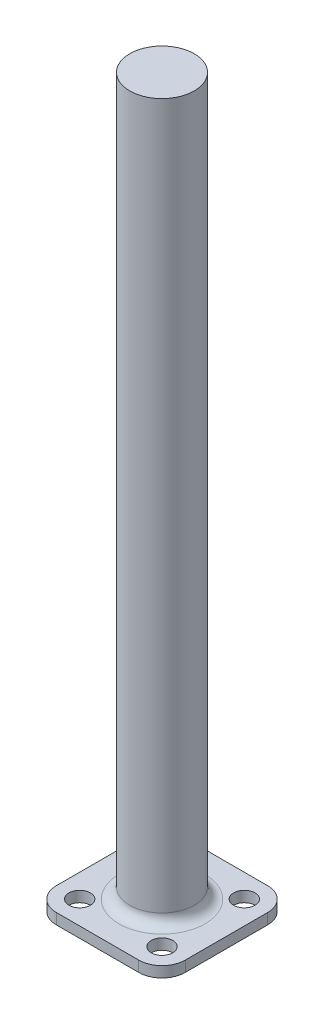
ISO-10303-21;
HEADER;
FILE_DESCRIPTION(('STEP AP214'),'2;1');
FILE_NAME('part.step','',(''),(''),'','','');
FILE_SCHEMA(('AUTOMOTIVE_DESIGN { 1 0 10303 214 1 1 1 1 }'));
ENDSEC;
DATA;
#1=APPLICATION_CONTEXT('core data for automotive mechanical design processes');
#2=APPLICATION_PROTOCOL_DEFINITION('international standard','automotive_design',2000,#1);
#3=PRODUCT_CONTEXT('',#1,'mechanical');
#4=PRODUCT('Part','Part','',(#3));
#5=PRODUCT_RELATED_PRODUCT_CATEGORY('part','',(#4));
#6=PRODUCT_DEFINITION_FORMATION('','',#4);
#7=PRODUCT_DEFINITION_CONTEXT('part definition',#1,'design');
#8=PRODUCT_DEFINITION('design','',#6,#7);
#9=PRODUCT_DEFINITION_SHAPE('','',#8);
#10=(LENGTH_UNIT() NAMED_UNIT(*) SI_UNIT(.MILLI.,.METRE.));
#11=(NAMED_UNIT(*) PLANE_ANGLE_UNIT() SI_UNIT($,.RADIAN.));
#12=(NAMED_UNIT(*) SI_UNIT($,.STERADIAN.) SOLID_ANGLE_UNIT());
#13=UNCERTAINTY_MEASURE_WITH_UNIT(LENGTH_MEASURE(1.E-05),#10,'distance_accuracy_value','');
#14=(GEOMETRIC_REPRESENTATION_CONTEXT(3) GLOBAL_UNCERTAINTY_ASSIGNED_CONTEXT((#13)) GLOBAL_UNIT_ASSIGNED_CONTEXT((#10,
#11,#12)) REPRESENTATION_CONTEXT('',''));
#15=CARTESIAN_POINT('',(0.,0.,0.));
#16=DIRECTION('',(0.,0.,1.));
#17=DIRECTION('',(1.,0.,0.));
#18=AXIS2_PLACEMENT_3D('',#15,#16,#17);
#19=CARTESIAN_POINT('',(-9.,1.5,0.));
#20=DIRECTION('',(1.,0.,0.));
#21=DIRECTION('',(0.,0.,-1.));
#22=AXIS2_PLACEMENT_3D('',#19,#20,#21);
#23=PLANE('',#22);
#24=DIRECTION('',(0.,0.,1.));
#25=VECTOR('',#24,1.);
#26=CARTESIAN_POINT('',(-9.,0.,0.));
#27=LINE('',#26,#25);
#28=CARTESIAN_POINT('',(-9.,0.,-5.75));
#29=VERTEX_POINT('',#28);
#30=CARTESIAN_POINT('',(-9.,0.,5.75));
#31=VERTEX_POINT('',#30);
#32=EDGE_CURVE('E148',#29,#31,#27,.T.);
#33=ORIENTED_EDGE('',*,*,#32,.T.);
#34=DIRECTION('',(0.,-1.,0.));
#35=VECTOR('',#34,1.);
#36=CARTESIAN_POINT('',(-9.,1.5,5.75));
#37=LINE('',#36,#35);
#38=CARTESIAN_POINT('',(-9.,1.5,5.75));
#39=VERTEX_POINT('',#38);
#40=EDGE_CURVE('E177',#39,#31,#37,.T.);
#41=ORIENTED_EDGE('',*,*,#40,.F.);
#42=DIRECTION('',(0.,0.,1.));
#43=VECTOR('',#42,1.);
#44=CARTESIAN_POINT('',(-9.,1.5,0.));
#45=LINE('',#44,#43);
#46=CARTESIAN_POINT('',(-9.,1.5,-5.75));
#47=VERTEX_POINT('',#46);
#48=EDGE_CURVE('E242',#47,#39,#45,.T.);
#49=ORIENTED_EDGE('',*,*,#48,.F.);
#50=DIRECTION('',(0.,-1.,0.));
#51=VECTOR('',#50,1.);
#52=CARTESIAN_POINT('',(-9.,1.5,-5.75));
#53=LINE('',#52,#51);
#54=EDGE_CURVE('E131',#47,#29,#53,.T.);
#55=ORIENTED_EDGE('',*,*,#54,.T.);
#56=EDGE_LOOP('',(#33,#41,#49,#55));
#57=FACE_BOUND('',#56,.T.);
#58=ADVANCED_FACE('F39',(#57),#23,.F.);
#59=CARTESIAN_POINT('',(-5.75,1.5,5.75));
#60=DIRECTION('',(0.,-1.,0.));
#61=DIRECTION('',(0.,0.,-1.));
#62=AXIS2_PLACEMENT_3D('',#59,#60,#61);
#63=CYLINDRICAL_SURFACE('',#62,3.25);
#64=CARTESIAN_POINT('',(-5.75,0.,5.75));
#65=DIRECTION('',(0.,1.,0.));
#66=DIRECTION('',(0.,0.,1.));
#67=AXIS2_PLACEMENT_3D('',#64,#65,#66);
#68=CIRCLE('',#67,3.25);
#69=CARTESIAN_POINT('',(-5.75,0.,9.));
#70=VERTEX_POINT('',#69);
#71=EDGE_CURVE('E151',#31,#70,#68,.T.);
#72=ORIENTED_EDGE('',*,*,#71,.T.);
#73=DIRECTION('',(0.,-1.,0.));
#74=VECTOR('',#73,1.);
#75=CARTESIAN_POINT('',(-5.75,1.5,9.));
#76=LINE('',#75,#74);
#77=CARTESIAN_POINT('',(-5.75,1.5,9.));
#78=VERTEX_POINT('',#77);
#79=EDGE_CURVE('E174',#78,#70,#76,.T.);
#80=ORIENTED_EDGE('',*,*,#79,.F.);
#81=CARTESIAN_POINT('',(-5.75,1.5,5.75));
#82=DIRECTION('',(0.,1.,0.));
#83=DIRECTION('',(0.,0.,1.));
#84=AXIS2_PLACEMENT_3D('',#81,#82,#83);
#85=CIRCLE('',#84,3.25);
#86=EDGE_CURVE('E96',#39,#78,#85,.T.);
#87=ORIENTED_EDGE('',*,*,#86,.F.);
#88=ORIENTED_EDGE('',*,*,#40,.T.);
#89=EDGE_LOOP('',(#72,#80,#87,#88));
#90=FACE_BOUND('',#89,.T.);
#91=ADVANCED_FACE('F194',(#90),#63,.T.);
#92=CARTESIAN_POINT('',(0.,1.5,9.));
#93=DIRECTION('',(0.,0.,-1.));
#94=DIRECTION('',(-1.,0.,0.));
#95=AXIS2_PLACEMENT_3D('',#92,#93,#94);
#96=PLANE('',#95);
#97=DIRECTION('',(1.,0.,0.));
#98=VECTOR('',#97,1.);
#99=CARTESIAN_POINT('',(0.,0.,9.));
#100=LINE('',#99,#98);
#101=CARTESIAN_POINT('',(5.75,0.,9.));
#102=VERTEX_POINT('',#101);
#103=EDGE_CURVE('E153',#70,#102,#100,.T.);
#104=ORIENTED_EDGE('',*,*,#103,.T.);
#105=DIRECTION('',(0.,-1.,0.));
#106=VECTOR('',#105,1.);
#107=CARTESIAN_POINT('',(5.75,1.5,9.));
#108=LINE('',#107,#106);
#109=CARTESIAN_POINT('',(5.75,1.5,9.));
#110=VERTEX_POINT('',#109);
#111=EDGE_CURVE('E171',#110,#102,#108,.T.);
#112=ORIENTED_EDGE('',*,*,#111,.F.);
#113=DIRECTION('',(1.,0.,0.));
#114=VECTOR('',#113,1.);
#115=CARTESIAN_POINT('',(0.,1.5,9.));
#116=LINE('',#115,#114);
#117=EDGE_CURVE('E245',#78,#110,#116,.T.);
#118=ORIENTED_EDGE('',*,*,#117,.F.);
#119=ORIENTED_EDGE('',*,*,#79,.T.);
#120=EDGE_LOOP('',(#104,#112,#118,#119));
#121=FACE_BOUND('',#120,.T.);
#122=ADVANCED_FACE('F200',(#121),#96,.F.);
#123=CARTESIAN_POINT('',(5.75,1.5,5.75));
#124=DIRECTION('',(0.,-1.,0.));
#125=DIRECTION('',(0.,0.,-1.));
#126=AXIS2_PLACEMENT_3D('',#123,#124,#125);
#127=CYLINDRICAL_SURFACE('',#126,3.25);
#128=CARTESIAN_POINT('',(5.75,0.,5.75));
#129=DIRECTION('',(0.,1.,0.));
#130=DIRECTION('',(0.,0.,1.));
#131=AXIS2_PLACEMENT_3D('',#128,#129,#130);
#132=CIRCLE('',#131,3.25);
#133=CARTESIAN_POINT('',(9.,0.,5.75));
#134=VERTEX_POINT('',#133);
#135=EDGE_CURVE('E155',#102,#134,#132,.T.);
#136=ORIENTED_EDGE('',*,*,#135,.T.);
#137=DIRECTION('',(0.,-1.,0.));
#138=VECTOR('',#137,1.);
#139=CARTESIAN_POINT('',(9.,1.5,5.75));
#140=LINE('',#139,#138);
#141=CARTESIAN_POINT('',(9.,1.5,5.75));
#142=VERTEX_POINT('',#141);
#143=EDGE_CURVE('E169',#142,#134,#140,.T.);
#144=ORIENTED_EDGE('',*,*,#143,.F.);
#145=CARTESIAN_POINT('',(5.75,1.5,5.75));
#146=DIRECTION('',(0.,1.,0.));
#147=DIRECTION('',(0.,0.,1.));
#148=AXIS2_PLACEMENT_3D('',#145,#146,#147);
#149=CIRCLE('',#148,3.25);
#150=EDGE_CURVE('E253',#110,#142,#149,.T.);
#151=ORIENTED_EDGE('',*,*,#150,.F.);
#152=ORIENTED_EDGE('',*,*,#111,.T.);
#153=EDGE_LOOP('',(#136,#144,#151,#152));
#154=FACE_BOUND('',#153,.T.);
#155=ADVANCED_FACE('F260',(#154),#127,.T.);
#156=CARTESIAN_POINT('',(9.,1.5,0.));
#157=DIRECTION('',(1.,0.,0.));
#158=DIRECTION('',(0.,0.,-1.));
#159=AXIS2_PLACEMENT_3D('',#156,#157,#158);
#160=PLANE('',#159);
#161=DIRECTION('',(0.,0.,1.));
#162=VECTOR('',#161,1.);
#163=CARTESIAN_POINT('',(9.,0.,0.));
#164=LINE('',#163,#162);
#165=CARTESIAN_POINT('',(9.,0.,-5.75));
#166=VERTEX_POINT('',#165);
#167=EDGE_CURVE('E158',#166,#134,#164,.T.);
#168=ORIENTED_EDGE('',*,*,#167,.F.);
#169=DIRECTION('',(0.,-1.,0.));
#170=VECTOR('',#169,1.);
#171=CARTESIAN_POINT('',(9.,1.5,-5.75));
#172=LINE('',#171,#170);
#173=CARTESIAN_POINT('',(9.,1.5,-5.75));
#174=VERTEX_POINT('',#173);
#175=EDGE_CURVE('E127',#174,#166,#172,.T.);
#176=ORIENTED_EDGE('',*,*,#175,.F.);
#177=DIRECTION('',(0.,0.,1.));
#178=VECTOR('',#177,1.);
#179=CARTESIAN_POINT('',(9.,1.5,0.));
#180=LINE('',#179,#178);
#181=EDGE_CURVE('E116',#174,#142,#180,.T.);
#182=ORIENTED_EDGE('',*,*,#181,.T.);
#183=ORIENTED_EDGE('',*,*,#143,.T.);
#184=EDGE_LOOP('',(#168,#176,#182,#183));
#185=FACE_BOUND('',#184,.T.);
#186=ADVANCED_FACE('F256',(#185),#160,.T.);
#187=CARTESIAN_POINT('',(5.75,1.5,-5.75));
#188=DIRECTION('',(0.,-1.,0.));
#189=DIRECTION('',(0.,0.,-1.));
#190=AXIS2_PLACEMENT_3D('',#187,#188,#189);
#191=CYLINDRICAL_SURFACE('',#190,3.25);
#192=CARTESIAN_POINT('',(5.75,0.,-5.75));
#193=DIRECTION('',(0.,1.,0.));
#194=DIRECTION('',(0.,0.,1.));
#195=AXIS2_PLACEMENT_3D('',#192,#193,#194);
#196=CIRCLE('',#195,3.25);
#197=CARTESIAN_POINT('',(5.75,0.,-9.));
#198=VERTEX_POINT('',#197);
#199=EDGE_CURVE('E123',#166,#198,#196,.T.);
#200=ORIENTED_EDGE('',*,*,#199,.T.);
#201=DIRECTION('',(0.,-1.,0.));
#202=VECTOR('',#201,1.);
#203=CARTESIAN_POINT('',(5.75,1.5,-9.));
#204=LINE('',#203,#202);
#205=CARTESIAN_POINT('',(5.75,1.5,-9.));
#206=VERTEX_POINT('',#205);
#207=EDGE_CURVE('E120',#206,#198,#204,.T.);
#208=ORIENTED_EDGE('',*,*,#207,.F.);
#209=CARTESIAN_POINT('',(5.75,1.5,-5.75));
#210=DIRECTION('',(0.,1.,0.));
#211=DIRECTION('',(0.,0.,1.));
#212=AXIS2_PLACEMENT_3D('',#209,#210,#211);
#213=CIRCLE('',#212,3.25);
#214=EDGE_CURVE('E110',#174,#206,#213,.T.);
#215=ORIENTED_EDGE('',*,*,#214,.F.);
#216=ORIENTED_EDGE('',*,*,#175,.T.);
#217=EDGE_LOOP('',(#200,#208,#215,#216));
#218=FACE_BOUND('',#217,.T.);
#219=ADVANCED_FACE('F121',(#218),#191,.T.);
#220=CARTESIAN_POINT('',(0.,1.5,-9.));
#221=DIRECTION('',(0.,0.,-1.));
#222=DIRECTION('',(-1.,0.,0.));
#223=AXIS2_PLACEMENT_3D('',#220,#221,#222);
#224=PLANE('',#223);
#225=DIRECTION('',(1.,0.,0.));
#226=VECTOR('',#225,1.);
#227=CARTESIAN_POINT('',(0.,0.,-9.));
#228=LINE('',#227,#226);
#229=CARTESIAN_POINT('',(-5.75,0.,-9.));
#230=VERTEX_POINT('',#229);
#231=EDGE_CURVE('E162',#230,#198,#228,.T.);
#232=ORIENTED_EDGE('',*,*,#231,.F.);
#233=DIRECTION('',(0.,-1.,0.));
#234=VECTOR('',#233,1.);
#235=CARTESIAN_POINT('',(-5.75,1.5,-9.));
#236=LINE('',#235,#234);
#237=CARTESIAN_POINT('',(-5.75,1.5,-9.));
#238=VERTEX_POINT('',#237);
#239=EDGE_CURVE('E84',#238,#230,#236,.T.);
#240=ORIENTED_EDGE('',*,*,#239,.F.);
#241=DIRECTION('',(1.,0.,0.));
#242=VECTOR('',#241,1.);
#243=CARTESIAN_POINT('',(0.,1.5,-9.));
#244=LINE('',#243,#242);
#245=EDGE_CURVE('E114',#238,#206,#244,.T.);
#246=ORIENTED_EDGE('',*,*,#245,.T.);
#247=ORIENTED_EDGE('',*,*,#207,.T.);
#248=EDGE_LOOP('',(#232,#240,#246,#247));
#249=FACE_BOUND('',#248,.T.);
#250=ADVANCED_FACE('F129',(#249),#224,.T.);
#251=CARTESIAN_POINT('',(-5.75,1.5,-5.75));
#252=DIRECTION('',(0.,-1.,0.));
#253=DIRECTION('',(0.,0.,-1.));
#254=AXIS2_PLACEMENT_3D('',#251,#252,#253);
#255=CYLINDRICAL_SURFACE('',#254,1.5);
#256=CARTESIAN_POINT('',(-5.75,1.5,-5.75));
#257=DIRECTION('',(0.,1.,0.));
#258=DIRECTION('',(0.,0.,1.));
#259=AXIS2_PLACEMENT_3D('',#256,#257,#258);
#260=CIRCLE('',#259,1.5);
#261=CARTESIAN_POINT('',(-5.75,1.5,-4.25));
#262=VERTEX_POINT('',#261);
#263=EDGE_CURVE('E243',#262,#262,#260,.T.);
#264=ORIENTED_EDGE('',*,*,#263,.T.);
#265=EDGE_LOOP('',(#264));
#266=FACE_BOUND('',#265,.T.);
#267=CARTESIAN_POINT('',(-5.75,0.,-5.75));
#268=DIRECTION('',(0.,1.,0.));
#269=DIRECTION('',(0.,0.,1.));
#270=AXIS2_PLACEMENT_3D('',#267,#268,#269);
#271=CIRCLE('',#270,1.5);
#272=CARTESIAN_POINT('',(-5.75,0.,-4.25));
#273=VERTEX_POINT('',#272);
#274=EDGE_CURVE('E145',#273,#273,#271,.T.);
#275=ORIENTED_EDGE('',*,*,#274,.F.);
#276=EDGE_LOOP('',(#275));
#277=FACE_BOUND('',#276,.T.);
#278=ADVANCED_FACE('F204',(#266,#277),#255,.F.);
#279=CARTESIAN_POINT('',(5.75,1.5,5.75));
#280=DIRECTION('',(0.,-1.,0.));
#281=DIRECTION('',(0.,0.,-1.));
#282=AXIS2_PLACEMENT_3D('',#279,#280,#281);
#283=CYLINDRICAL_SURFACE('',#282,1.5);
#284=CARTESIAN_POINT('',(5.75,1.5,5.75));
#285=DIRECTION('',(0.,1.,0.));
#286=DIRECTION('',(0.,0.,1.));
#287=AXIS2_PLACEMENT_3D('',#284,#285,#286);
#288=CIRCLE('',#287,1.5);
#289=CARTESIAN_POINT('',(5.75,1.5,7.25));
#290=VERTEX_POINT('',#289);
#291=EDGE_CURVE('E248',#290,#290,#288,.T.);
#292=ORIENTED_EDGE('',*,*,#291,.T.);
#293=EDGE_LOOP('',(#292));
#294=FACE_BOUND('',#293,.T.);
#295=CARTESIAN_POINT('',(5.75,0.,5.75));
#296=DIRECTION('',(0.,1.,0.));
#297=DIRECTION('',(0.,0.,1.));
#298=AXIS2_PLACEMENT_3D('',#295,#296,#297);
#299=CIRCLE('',#298,1.5);
#300=CARTESIAN_POINT('',(5.75,0.,7.25));
#301=VERTEX_POINT('',#300);
#302=EDGE_CURVE('E142',#301,#301,#299,.T.);
#303=ORIENTED_EDGE('',*,*,#302,.F.);
#304=EDGE_LOOP('',(#303));
#305=FACE_BOUND('',#304,.T.);
#306=ADVANCED_FACE('F207',(#294,#305),#283,.F.);
#307=CARTESIAN_POINT('',(5.75,1.5,-5.75));
#308=DIRECTION('',(0.,-1.,0.));
#309=DIRECTION('',(0.,0.,-1.));
#310=AXIS2_PLACEMENT_3D('',#307,#308,#309);
#311=CYLINDRICAL_SURFACE('',#310,1.5);
#312=CARTESIAN_POINT('',(5.75,1.5,-5.75));
#313=DIRECTION('',(0.,1.,0.));
#314=DIRECTION('',(0.,0.,1.));
#315=AXIS2_PLACEMENT_3D('',#312,#313,#314);
#316=CIRCLE('',#315,1.5);
#317=CARTESIAN_POINT('',(5.75,1.5,-4.25));
#318=VERTEX_POINT('',#317);
#319=EDGE_CURVE('E420',#318,#318,#316,.T.);
#320=ORIENTED_EDGE('',*,*,#319,.T.);
#321=EDGE_LOOP('',(#320));
#322=FACE_BOUND('',#321,.T.);
#323=CARTESIAN_POINT('',(5.75,0.,-5.75));
#324=DIRECTION('',(0.,1.,0.));
#325=DIRECTION('',(0.,0.,1.));
#326=AXIS2_PLACEMENT_3D('',#323,#324,#325);
#327=CIRCLE('',#326,1.5);
#328=CARTESIAN_POINT('',(5.75,0.,-4.25));
#329=VERTEX_POINT('',#328);
#330=EDGE_CURVE('E138',#329,#329,#327,.T.);
#331=ORIENTED_EDGE('',*,*,#330,.F.);
#332=EDGE_LOOP('',(#331));
#333=FACE_BOUND('',#332,.T.);
#334=ADVANCED_FACE('F211',(#322,#333),#311,.F.);
#335=CARTESIAN_POINT('',(-5.75,1.5,5.75));
#336=DIRECTION('',(0.,-1.,0.));
#337=DIRECTION('',(0.,0.,-1.));
#338=AXIS2_PLACEMENT_3D('',#335,#336,#337);
#339=CYLINDRICAL_SURFACE('',#338,1.5);
#340=CARTESIAN_POINT('',(-5.75,1.5,5.75));
#341=DIRECTION('',(0.,1.,0.));
#342=DIRECTION('',(0.,0.,1.));
#343=AXIS2_PLACEMENT_3D('',#340,#341,#342);
#344=CIRCLE('',#343,1.5);
#345=CARTESIAN_POINT('',(-5.75,1.5,7.25));
#346=VERTEX_POINT('',#345);
#347=EDGE_CURVE('E165',#346,#346,#344,.T.);
#348=ORIENTED_EDGE('',*,*,#347,.T.);
#349=EDGE_LOOP('',(#348));
#350=FACE_BOUND('',#349,.T.);
#351=CARTESIAN_POINT('',(-5.75,0.,5.75));
#352=DIRECTION('',(0.,1.,0.));
#353=DIRECTION('',(0.,0.,1.));
#354=AXIS2_PLACEMENT_3D('',#351,#352,#353);
#355=CIRCLE('',#354,1.5);
#356=CARTESIAN_POINT('',(-5.75,0.,7.25));
#357=VERTEX_POINT('',#356);
#358=EDGE_CURVE('E135',#357,#357,#355,.T.);
#359=ORIENTED_EDGE('',*,*,#358,.F.);
#360=EDGE_LOOP('',(#359));
#361=FACE_BOUND('',#360,.T.);
#362=ADVANCED_FACE('F214',(#350,#361),#339,.F.);
#363=CARTESIAN_POINT('',(-5.75,1.5,-5.75));
#364=DIRECTION('',(0.,-1.,0.));
#365=DIRECTION('',(0.,0.,-1.));
#366=AXIS2_PLACEMENT_3D('',#363,#364,#365);
#367=CYLINDRICAL_SURFACE('',#366,3.25);
#368=CARTESIAN_POINT('',(-5.75,0.,-5.75));
#369=DIRECTION('',(0.,1.,0.));
#370=DIRECTION('',(0.,0.,1.));
#371=AXIS2_PLACEMENT_3D('',#368,#369,#370);
#372=CIRCLE('',#371,3.25);
#373=EDGE_CURVE('E87',#230,#29,#372,.T.);
#374=ORIENTED_EDGE('',*,*,#373,.T.);
#375=ORIENTED_EDGE('',*,*,#54,.F.);
#376=CARTESIAN_POINT('',(-5.75,1.5,-5.75));
#377=DIRECTION('',(0.,1.,0.));
#378=DIRECTION('',(0.,0.,1.));
#379=AXIS2_PLACEMENT_3D('',#376,#377,#378);
#380=CIRCLE('',#379,3.25);
#381=EDGE_CURVE('E56',#238,#47,#380,.T.);
#382=ORIENTED_EDGE('',*,*,#381,.F.);
#383=ORIENTED_EDGE('',*,*,#239,.T.);
#384=EDGE_LOOP('',(#374,#375,#382,#383));
#385=FACE_BOUND('',#384,.T.);
#386=ADVANCED_FACE('F217',(#385),#367,.T.);
#387=CARTESIAN_POINT('',(0.,1.5,0.));
#388=DIRECTION('',(0.,1.,0.));
#389=DIRECTION('',(0.,0.,1.));
#390=AXIS2_PLACEMENT_3D('',#387,#388,#389);
#391=PLANE('',#390);
#392=CARTESIAN_POINT('',(0.,1.5,0.));
#393=DIRECTION('',(0.,1.,0.));
#394=DIRECTION('',(0.,0.,1.));
#395=AXIS2_PLACEMENT_3D('',#392,#393,#394);
#396=CIRCLE('',#395,6.);
#397=CARTESIAN_POINT('',(0.,1.5,6.));
#398=VERTEX_POINT('',#397);
#399=EDGE_CURVE('E11',#398,#398,#396,.F.);
#400=ORIENTED_EDGE('',*,*,#399,.T.);
#401=EDGE_LOOP('',(#400));
#402=FACE_BOUND('',#401,.T.);
#403=ORIENTED_EDGE('',*,*,#347,.F.);
#404=EDGE_LOOP('',(#403));
#405=FACE_BOUND('',#404,.T.);
#406=ORIENTED_EDGE('',*,*,#319,.F.);
#407=EDGE_LOOP('',(#406));
#408=FACE_BOUND('',#407,.T.);
#409=ORIENTED_EDGE('',*,*,#291,.F.);
#410=EDGE_LOOP('',(#409));
#411=FACE_BOUND('',#410,.T.);
#412=ORIENTED_EDGE('',*,*,#263,.F.);
#413=EDGE_LOOP('',(#412));
#414=FACE_BOUND('',#413,.T.);
#415=ORIENTED_EDGE('',*,*,#48,.T.);
#416=ORIENTED_EDGE('',*,*,#86,.T.);
#417=ORIENTED_EDGE('',*,*,#117,.T.);
#418=ORIENTED_EDGE('',*,*,#150,.T.);
#419=ORIENTED_EDGE('',*,*,#181,.F.);
#420=ORIENTED_EDGE('',*,*,#214,.T.);
#421=ORIENTED_EDGE('',*,*,#245,.F.);
#422=ORIENTED_EDGE('',*,*,#381,.T.);
#423=EDGE_LOOP('',(#415,#416,#417,#418,#419,#420,#421,#422));
#424=FACE_BOUND('',#423,.T.);
#425=ADVANCED_FACE('F112',(#402,#405,#408,#411,#414,#424),#391,.T.);
#426=CARTESIAN_POINT('',(0.,0.,0.));
#427=DIRECTION('',(0.,1.,0.));
#428=DIRECTION('',(0.,0.,1.));
#429=AXIS2_PLACEMENT_3D('',#426,#427,#428);
#430=PLANE('',#429);
#431=ORIENTED_EDGE('',*,*,#358,.T.);
#432=EDGE_LOOP('',(#431));
#433=FACE_BOUND('',#432,.T.);
#434=ORIENTED_EDGE('',*,*,#330,.T.);
#435=EDGE_LOOP('',(#434));
#436=FACE_BOUND('',#435,.T.);
#437=ORIENTED_EDGE('',*,*,#302,.T.);
#438=EDGE_LOOP('',(#437));
#439=FACE_BOUND('',#438,.T.);
#440=ORIENTED_EDGE('',*,*,#274,.T.);
#441=EDGE_LOOP('',(#440));
#442=FACE_BOUND('',#441,.T.);
#443=ORIENTED_EDGE('',*,*,#32,.F.);
#444=ORIENTED_EDGE('',*,*,#373,.F.);
#445=ORIENTED_EDGE('',*,*,#231,.T.);
#446=ORIENTED_EDGE('',*,*,#199,.F.);
#447=ORIENTED_EDGE('',*,*,#167,.T.);
#448=ORIENTED_EDGE('',*,*,#135,.F.);
#449=ORIENTED_EDGE('',*,*,#103,.F.);
#450=ORIENTED_EDGE('',*,*,#71,.F.);
#451=EDGE_LOOP('',(#443,#444,#445,#446,#447,#448,#449,#450));
#452=FACE_BOUND('',#451,.T.);
#453=ADVANCED_FACE('F228',(#433,#436,#439,#442,#452),#430,.F.);
#454=CARTESIAN_POINT('',(0.,101.5,0.));
#455=DIRECTION('',(0.,-1.,0.));
#456=DIRECTION('',(0.,0.,-1.));
#457=AXIS2_PLACEMENT_3D('',#454,#455,#456);
#458=CYLINDRICAL_SURFACE('',#457,4.5);
#459=CARTESIAN_POINT('',(0.,3.,0.));
#460=DIRECTION('',(0.,1.,0.));
#461=DIRECTION('',(0.,0.,1.));
#462=AXIS2_PLACEMENT_3D('',#459,#460,#461);
#463=CIRCLE('',#462,4.5);
#464=CARTESIAN_POINT('',(0.,3.,4.5));
#465=VERTEX_POINT('',#464);
#466=EDGE_CURVE('E48',#465,#465,#463,.T.);
#467=ORIENTED_EDGE('',*,*,#466,.T.);
#468=EDGE_LOOP('',(#467));
#469=FACE_BOUND('',#468,.T.);
#470=CARTESIAN_POINT('',(0.,101.5,0.));
#471=DIRECTION('',(0.,1.,0.));
#472=DIRECTION('',(0.,0.,1.));
#473=AXIS2_PLACEMENT_3D('',#470,#471,#472);
#474=CIRCLE('',#473,4.5);
#475=CARTESIAN_POINT('',(0.,101.5,4.5));
#476=VERTEX_POINT('',#475);
#477=EDGE_CURVE('E139',#476,#476,#474,.T.);
#478=ORIENTED_EDGE('',*,*,#477,.F.);
#479=EDGE_LOOP('',(#478));
#480=FACE_BOUND('',#479,.T.);
#481=ADVANCED_FACE('F181',(#469,#480),#458,.T.);
#482=CARTESIAN_POINT('',(0.,101.5,0.));
#483=DIRECTION('',(0.,1.,0.));
#484=DIRECTION('',(0.,0.,1.));
#485=AXIS2_PLACEMENT_3D('',#482,#483,#484);
#486=PLANE('',#485);
#487=ORIENTED_EDGE('',*,*,#477,.T.);
#488=EDGE_LOOP('',(#487));
#489=FACE_BOUND('',#488,.T.);
#490=ADVANCED_FACE('F185',(#489),#486,.T.);
#491=CARTESIAN_POINT('',(0.,3.,0.));
#492=DIRECTION('',(0.,1.,0.));
#493=DIRECTION('',(0.,0.,1.));
#494=AXIS2_PLACEMENT_3D('',#491,#492,#493);
#495=TOROIDAL_SURFACE('',#494,6.,1.5);
#496=ORIENTED_EDGE('',*,*,#399,.F.);
#497=EDGE_LOOP('',(#496));
#498=FACE_BOUND('',#497,.T.);
#499=ORIENTED_EDGE('',*,*,#466,.F.);
#500=EDGE_LOOP('',(#499));
#501=FACE_BOUND('',#500,.T.);
#502=ADVANCED_FACE('F41',(#498,#501),#495,.F.);
#503=CLOSED_SHELL('',(#58,#91,#122,#155,#186,#219,#250,#278,#306,#334,#362,#386,#425,#453,#481,
#490,#502));
#504=MANIFOLD_SOLID_BREP('B2',#503);
#505=ADVANCED_BREP_SHAPE_REPRESENTATION('',(#18,#504),#14);
#506=SHAPE_DEFINITION_REPRESENTATION(#9,#505);
ENDSEC;
END-ISO-10303-21;
